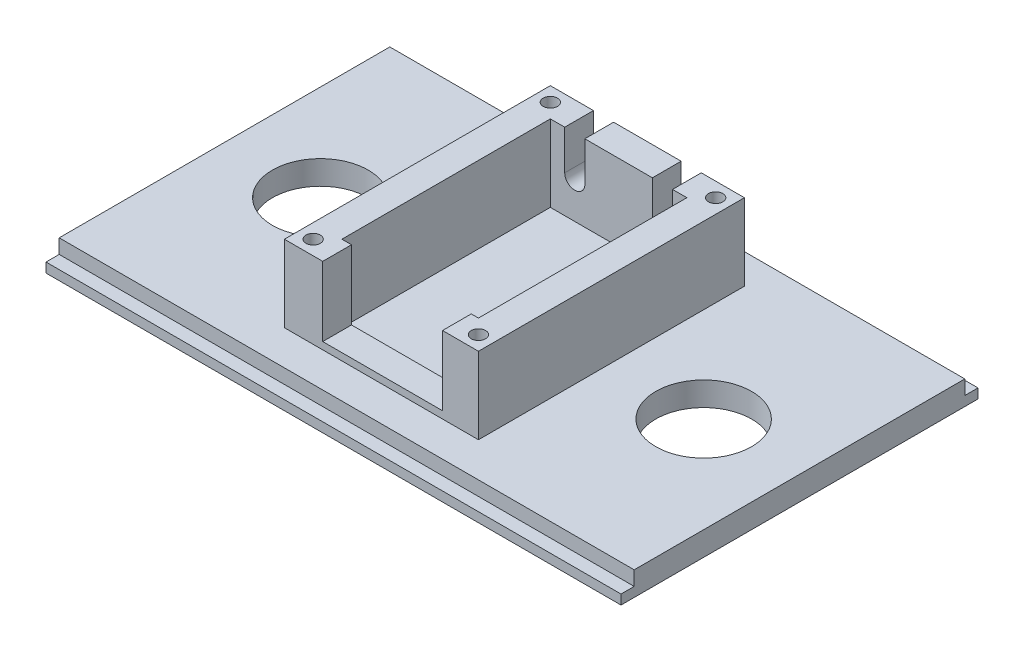
ISO-10303-21;
HEADER;
FILE_DESCRIPTION(('STEP AP214'),'2;1');
FILE_NAME('part.step','',(''),(''),'','','');
FILE_SCHEMA(('AUTOMOTIVE_DESIGN { 1 0 10303 214 1 1 1 1 }'));
ENDSEC;
DATA;
#1=APPLICATION_CONTEXT('core data for automotive mechanical design processes');
#2=APPLICATION_PROTOCOL_DEFINITION('international standard','automotive_design',2000,#1);
#3=PRODUCT_CONTEXT('',#1,'mechanical');
#4=PRODUCT('Part','Part','',(#3));
#5=PRODUCT_RELATED_PRODUCT_CATEGORY('part','',(#4));
#6=PRODUCT_DEFINITION_FORMATION('','',#4);
#7=PRODUCT_DEFINITION_CONTEXT('part definition',#1,'design');
#8=PRODUCT_DEFINITION('design','',#6,#7);
#9=PRODUCT_DEFINITION_SHAPE('','',#8);
#10=(LENGTH_UNIT() NAMED_UNIT(*) SI_UNIT(.MILLI.,.METRE.));
#11=(NAMED_UNIT(*) PLANE_ANGLE_UNIT() SI_UNIT($,.RADIAN.));
#12=(NAMED_UNIT(*) SI_UNIT($,.STERADIAN.) SOLID_ANGLE_UNIT());
#13=UNCERTAINTY_MEASURE_WITH_UNIT(LENGTH_MEASURE(1.E-05),#10,'distance_accuracy_value','');
#14=(GEOMETRIC_REPRESENTATION_CONTEXT(3) GLOBAL_UNCERTAINTY_ASSIGNED_CONTEXT((#13)) GLOBAL_UNIT_ASSIGNED_CONTEXT((#10,
#11,#12)) REPRESENTATION_CONTEXT('',''));
#15=CARTESIAN_POINT('',(0.,0.,0.));
#16=DIRECTION('',(0.,0.,1.));
#17=DIRECTION('',(1.,0.,0.));
#18=AXIS2_PLACEMENT_3D('',#15,#16,#17);
#19=CARTESIAN_POINT('',(0.,21.,0.));
#20=DIRECTION('',(0.,-1.,0.));
#21=DIRECTION('',(0.,0.,-1.));
#22=AXIS2_PLACEMENT_3D('',#19,#20,#21);
#23=PLANE('',#22);
#24=DIRECTION('',(0.,0.,-1.));
#25=VECTOR('',#24,1.);
#26=CARTESIAN_POINT('',(7.05,21.,-12.25));
#27=LINE('',#26,#25);
#28=CARTESIAN_POINT('',(7.05,21.,-22.25));
#29=VERTEX_POINT('',#28);
#30=CARTESIAN_POINT('',(7.05,21.,-28.25));
#31=VERTEX_POINT('',#30);
#32=EDGE_CURVE('E247',#29,#31,#27,.T.);
#33=ORIENTED_EDGE('',*,*,#32,.T.);
#34=DIRECTION('',(-1.,0.,0.));
#35=VECTOR('',#34,1.);
#36=CARTESIAN_POINT('',(-20.25,21.,-28.25));
#37=LINE('',#36,#35);
#38=CARTESIAN_POINT('',(-7.04999999999999,21.,-28.25));
#39=VERTEX_POINT('',#38);
#40=EDGE_CURVE('E326',#31,#39,#37,.T.);
#41=ORIENTED_EDGE('',*,*,#40,.T.);
#42=DIRECTION('',(0.,0.,-1.));
#43=VECTOR('',#42,1.);
#44=CARTESIAN_POINT('',(-7.04999999999999,21.,-12.25));
#45=LINE('',#44,#43);
#46=CARTESIAN_POINT('',(-7.04999999999999,21.,-22.25));
#47=VERTEX_POINT('',#46);
#48=EDGE_CURVE('E263',#47,#39,#45,.T.);
#49=ORIENTED_EDGE('',*,*,#48,.F.);
#50=DIRECTION('',(-1.,0.,0.));
#51=VECTOR('',#50,1.);
#52=CARTESIAN_POINT('',(14.25,21.,-22.25));
#53=LINE('',#52,#51);
#54=EDGE_CURVE('E299',#29,#47,#53,.T.);
#55=ORIENTED_EDGE('',*,*,#54,.F.);
#56=EDGE_LOOP('',(#33,#41,#49,#55));
#57=FACE_BOUND('',#56,.T.);
#58=ADVANCED_FACE('F36',(#57),#23,.F.);
#59=CARTESIAN_POINT('',(-17.25,21.,24.25));
#60=DIRECTION('',(0.,1.,0.));
#61=DIRECTION('',(0.,0.,1.));
#62=AXIS2_PLACEMENT_3D('',#59,#60,#61);
#63=CIRCLE('',#62,1.5);
#64=CARTESIAN_POINT('',(-17.25,21.,25.75));
#65=VERTEX_POINT('',#64);
#66=EDGE_CURVE('E538',#65,#65,#63,.T.);
#67=ORIENTED_EDGE('',*,*,#66,.F.);
#68=EDGE_LOOP('',(#67));
#69=FACE_BOUND('',#68,.T.);
#70=CARTESIAN_POINT('',(-17.25,21.,-25.25));
#71=DIRECTION('',(0.,1.,0.));
#72=DIRECTION('',(0.,0.,1.));
#73=AXIS2_PLACEMENT_3D('',#70,#71,#72);
#74=CIRCLE('',#73,1.5);
#75=CARTESIAN_POINT('',(-17.25,21.,-23.75));
#76=VERTEX_POINT('',#75);
#77=EDGE_CURVE('E528',#76,#76,#74,.T.);
#78=ORIENTED_EDGE('',*,*,#77,.F.);
#79=EDGE_LOOP('',(#78));
#80=FACE_BOUND('',#79,.T.);
#81=DIRECTION('',(0.,0.,-1.));
#82=VECTOR('',#81,1.);
#83=CARTESIAN_POINT('',(-11.25,21.,-12.25));
#84=LINE('',#83,#82);
#85=CARTESIAN_POINT('',(-11.25,21.,-22.25));
#86=VERTEX_POINT('',#85);
#87=CARTESIAN_POINT('',(-11.25,21.,-28.25));
#88=VERTEX_POINT('',#87);
#89=EDGE_CURVE('E59',#86,#88,#84,.T.);
#90=ORIENTED_EDGE('',*,*,#89,.T.);
#91=CARTESIAN_POINT('',(-20.25,21.,-28.25));
#92=VERTEX_POINT('',#91);
#93=EDGE_CURVE('E321',#88,#92,#37,.T.);
#94=ORIENTED_EDGE('',*,*,#93,.T.);
#95=DIRECTION('',(0.,0.,1.));
#96=VECTOR('',#95,1.);
#97=CARTESIAN_POINT('',(-20.25,21.,27.25));
#98=LINE('',#97,#96);
#99=CARTESIAN_POINT('',(-20.25,21.,27.25));
#100=VERTEX_POINT('',#99);
#101=EDGE_CURVE('E325',#92,#100,#98,.T.);
#102=ORIENTED_EDGE('',*,*,#101,.T.);
#103=DIRECTION('',(1.,0.,0.));
#104=VECTOR('',#103,1.);
#105=CARTESIAN_POINT('',(-20.25,21.,27.25));
#106=LINE('',#105,#104);
#107=CARTESIAN_POINT('',(-12.25,21.,27.25));
#108=VERTEX_POINT('',#107);
#109=EDGE_CURVE('E329',#100,#108,#106,.T.);
#110=ORIENTED_EDGE('',*,*,#109,.T.);
#111=DIRECTION('',(0.,0.,1.));
#112=VECTOR('',#111,1.);
#113=CARTESIAN_POINT('',(-12.25,21.,11.25));
#114=LINE('',#113,#112);
#115=CARTESIAN_POINT('',(-12.25,21.,21.25));
#116=VERTEX_POINT('',#115);
#117=EDGE_CURVE('E275',#116,#108,#114,.T.);
#118=ORIENTED_EDGE('',*,*,#117,.F.);
#119=DIRECTION('',(1.,0.,0.));
#120=VECTOR('',#119,1.);
#121=CARTESIAN_POINT('',(14.25,21.,21.25));
#122=LINE('',#121,#120);
#123=CARTESIAN_POINT('',(-14.25,21.,21.25));
#124=VERTEX_POINT('',#123);
#125=EDGE_CURVE('E288',#124,#116,#122,.T.);
#126=ORIENTED_EDGE('',*,*,#125,.F.);
#127=DIRECTION('',(0.,0.,1.));
#128=VECTOR('',#127,1.);
#129=CARTESIAN_POINT('',(-14.25,21.,21.25));
#130=LINE('',#129,#128);
#131=CARTESIAN_POINT('',(-14.25,21.,-22.25));
#132=VERTEX_POINT('',#131);
#133=EDGE_CURVE('E284',#132,#124,#130,.T.);
#134=ORIENTED_EDGE('',*,*,#133,.F.);
#135=EDGE_CURVE('E294',#86,#132,#53,.T.);
#136=ORIENTED_EDGE('',*,*,#135,.F.);
#137=EDGE_LOOP('',(#90,#94,#102,#110,#118,#126,#134,#136));
#138=FACE_BOUND('',#137,.T.);
#139=ADVANCED_FACE('F442',(#69,#80,#138),#23,.F.);
#140=CARTESIAN_POINT('',(0.,5.,0.));
#141=DIRECTION('',(0.,1.,0.));
#142=DIRECTION('',(0.,0.,1.));
#143=AXIS2_PLACEMENT_3D('',#140,#141,#142);
#144=PLANE('',#143);
#145=CARTESIAN_POINT('',(-40.,5.,0.));
#146=DIRECTION('',(0.,1.,0.));
#147=DIRECTION('',(0.,0.,1.));
#148=AXIS2_PLACEMENT_3D('',#145,#146,#147);
#149=CIRCLE('',#148,10.);
#150=CARTESIAN_POINT('',(-40.,5.,10.));
#151=VERTEX_POINT('',#150);
#152=EDGE_CURVE('E541',#151,#151,#149,.T.);
#153=ORIENTED_EDGE('',*,*,#152,.F.);
#154=EDGE_LOOP('',(#153));
#155=FACE_BOUND('',#154,.T.);
#156=CARTESIAN_POINT('',(40.,5.,0.));
#157=DIRECTION('',(0.,1.,0.));
#158=DIRECTION('',(0.,0.,1.));
#159=AXIS2_PLACEMENT_3D('',#156,#157,#158);
#160=CIRCLE('',#159,10.);
#161=CARTESIAN_POINT('',(40.,5.,10.));
#162=VERTEX_POINT('',#161);
#163=EDGE_CURVE('E912',#162,#162,#160,.T.);
#164=ORIENTED_EDGE('',*,*,#163,.F.);
#165=EDGE_LOOP('',(#164));
#166=FACE_BOUND('',#165,.T.);
#167=DIRECTION('',(0.,0.,1.));
#168=VECTOR('',#167,1.);
#169=CARTESIAN_POINT('',(-60.,5.,-34.5));
#170=LINE('',#169,#168);
#171=CARTESIAN_POINT('',(-60.,5.,-34.5));
#172=VERTEX_POINT('',#171);
#173=CARTESIAN_POINT('',(-60.,5.,34.5));
#174=VERTEX_POINT('',#173);
#175=EDGE_CURVE('E351',#172,#174,#170,.T.);
#176=ORIENTED_EDGE('',*,*,#175,.T.);
#177=DIRECTION('',(1.,0.,0.));
#178=VECTOR('',#177,1.);
#179=CARTESIAN_POINT('',(-60.,5.,34.5));
#180=LINE('',#179,#178);
#181=CARTESIAN_POINT('',(60.,5.,34.5));
#182=VERTEX_POINT('',#181);
#183=EDGE_CURVE('E354',#174,#182,#180,.T.);
#184=ORIENTED_EDGE('',*,*,#183,.T.);
#185=DIRECTION('',(0.,0.,-1.));
#186=VECTOR('',#185,1.);
#187=CARTESIAN_POINT('',(60.,5.,-34.5));
#188=LINE('',#187,#186);
#189=CARTESIAN_POINT('',(60.,5.,-34.5));
#190=VERTEX_POINT('',#189);
#191=EDGE_CURVE('E357',#182,#190,#188,.T.);
#192=ORIENTED_EDGE('',*,*,#191,.T.);
#193=DIRECTION('',(-1.,0.,0.));
#194=VECTOR('',#193,1.);
#195=CARTESIAN_POINT('',(-60.,5.,-34.5));
#196=LINE('',#195,#194);
#197=EDGE_CURVE('E359',#190,#172,#196,.T.);
#198=ORIENTED_EDGE('',*,*,#197,.T.);
#199=EDGE_LOOP('',(#176,#184,#192,#198));
#200=FACE_BOUND('',#199,.T.);
#201=DIRECTION('',(-1.,0.,0.));
#202=VECTOR('',#201,1.);
#203=CARTESIAN_POINT('',(-20.25,5.,-28.25));
#204=LINE('',#203,#202);
#205=CARTESIAN_POINT('',(20.25,5.,-28.25));
#206=VERTEX_POINT('',#205);
#207=CARTESIAN_POINT('',(-20.25,5.,-28.25));
#208=VERTEX_POINT('',#207);
#209=EDGE_CURVE('E335',#206,#208,#204,.T.);
#210=ORIENTED_EDGE('',*,*,#209,.F.);
#211=DIRECTION('',(0.,0.,-1.));
#212=VECTOR('',#211,1.);
#213=CARTESIAN_POINT('',(20.25,5.,27.25));
#214=LINE('',#213,#212);
#215=CARTESIAN_POINT('',(20.25,5.,27.25));
#216=VERTEX_POINT('',#215);
#217=EDGE_CURVE('E317',#216,#206,#214,.T.);
#218=ORIENTED_EDGE('',*,*,#217,.F.);
#219=DIRECTION('',(1.,0.,0.));
#220=VECTOR('',#219,1.);
#221=CARTESIAN_POINT('',(-20.25,5.,27.25));
#222=LINE('',#221,#220);
#223=CARTESIAN_POINT('',(-20.25,5.,27.25));
#224=VERTEX_POINT('',#223);
#225=EDGE_CURVE('E322',#224,#216,#222,.T.);
#226=ORIENTED_EDGE('',*,*,#225,.F.);
#227=DIRECTION('',(0.,0.,1.));
#228=VECTOR('',#227,1.);
#229=CARTESIAN_POINT('',(-20.25,5.,27.25));
#230=LINE('',#229,#228);
#231=EDGE_CURVE('E337',#208,#224,#230,.T.);
#232=ORIENTED_EDGE('',*,*,#231,.F.);
#233=EDGE_LOOP('',(#210,#218,#226,#232));
#234=FACE_BOUND('',#233,.T.);
#235=ADVANCED_FACE('F471',(#155,#166,#200,#234),#144,.T.);
#236=CARTESIAN_POINT('',(0.,2.,0.));
#237=DIRECTION('',(0.,-1.,0.));
#238=DIRECTION('',(0.,0.,-1.));
#239=AXIS2_PLACEMENT_3D('',#236,#237,#238);
#240=PLANE('',#239);
#241=DIRECTION('',(-1.,0.,0.));
#242=VECTOR('',#241,1.);
#243=CARTESIAN_POINT('',(-60.,2.,-34.5));
#244=LINE('',#243,#242);
#245=CARTESIAN_POINT('',(60.,2.,-34.5));
#246=VERTEX_POINT('',#245);
#247=CARTESIAN_POINT('',(-60.,2.,-34.5));
#248=VERTEX_POINT('',#247);
#249=EDGE_CURVE('E355',#246,#248,#244,.T.);
#250=ORIENTED_EDGE('',*,*,#249,.F.);
#251=DIRECTION('',(0.,0.,-1.));
#252=VECTOR('',#251,1.);
#253=CARTESIAN_POINT('',(60.,2.,37.25));
#254=LINE('',#253,#252);
#255=CARTESIAN_POINT('',(60.,2.,-37.25));
#256=VERTEX_POINT('',#255);
#257=EDGE_CURVE('E381',#246,#256,#254,.T.);
#258=ORIENTED_EDGE('',*,*,#257,.T.);
#259=DIRECTION('',(-1.,0.,0.));
#260=VECTOR('',#259,1.);
#261=CARTESIAN_POINT('',(-60.,2.,-37.25));
#262=LINE('',#261,#260);
#263=CARTESIAN_POINT('',(-60.,2.,-37.25));
#264=VERTEX_POINT('',#263);
#265=EDGE_CURVE('E380',#256,#264,#262,.T.);
#266=ORIENTED_EDGE('',*,*,#265,.T.);
#267=DIRECTION('',(0.,0.,1.));
#268=VECTOR('',#267,1.);
#269=CARTESIAN_POINT('',(-60.,2.,37.25));
#270=LINE('',#269,#268);
#271=EDGE_CURVE('E384',#264,#248,#270,.T.);
#272=ORIENTED_EDGE('',*,*,#271,.T.);
#273=EDGE_LOOP('',(#250,#258,#266,#272));
#274=FACE_BOUND('',#273,.T.);
#275=ADVANCED_FACE('F787',(#274),#240,.F.);
#276=DIRECTION('',(1.,0.,0.));
#277=VECTOR('',#276,1.);
#278=CARTESIAN_POINT('',(-60.,2.,34.5));
#279=LINE('',#278,#277);
#280=CARTESIAN_POINT('',(-60.,2.,34.5));
#281=VERTEX_POINT('',#280);
#282=CARTESIAN_POINT('',(60.,2.,34.5));
#283=VERTEX_POINT('',#282);
#284=EDGE_CURVE('E350',#281,#283,#279,.T.);
#285=ORIENTED_EDGE('',*,*,#284,.F.);
#286=CARTESIAN_POINT('',(-60.,2.,37.25));
#287=VERTEX_POINT('',#286);
#288=EDGE_CURVE('E383',#281,#287,#270,.T.);
#289=ORIENTED_EDGE('',*,*,#288,.T.);
#290=DIRECTION('',(1.,0.,0.));
#291=VECTOR('',#290,1.);
#292=CARTESIAN_POINT('',(-60.,2.,37.25));
#293=LINE('',#292,#291);
#294=CARTESIAN_POINT('',(60.,2.,37.25));
#295=VERTEX_POINT('',#294);
#296=EDGE_CURVE('E386',#287,#295,#293,.T.);
#297=ORIENTED_EDGE('',*,*,#296,.T.);
#298=EDGE_CURVE('E378',#295,#283,#254,.T.);
#299=ORIENTED_EDGE('',*,*,#298,.T.);
#300=EDGE_LOOP('',(#285,#289,#297,#299));
#301=FACE_BOUND('',#300,.T.);
#302=ADVANCED_FACE('F831',(#301),#240,.F.);
#303=CARTESIAN_POINT('',(60.,2.,37.25));
#304=DIRECTION('',(-1.,0.,0.));
#305=DIRECTION('',(0.,0.,1.));
#306=AXIS2_PLACEMENT_3D('',#303,#304,#305);
#307=PLANE('',#306);
#308=DIRECTION('',(0.,0.,-1.));
#309=VECTOR('',#308,1.);
#310=CARTESIAN_POINT('',(60.,0.,37.25));
#311=LINE('',#310,#309);
#312=CARTESIAN_POINT('',(60.,0.,37.25));
#313=VERTEX_POINT('',#312);
#314=CARTESIAN_POINT('',(60.,0.,-37.25));
#315=VERTEX_POINT('',#314);
#316=EDGE_CURVE('E377',#313,#315,#311,.T.);
#317=ORIENTED_EDGE('',*,*,#316,.T.);
#318=DIRECTION('',(0.,-1.,0.));
#319=VECTOR('',#318,1.);
#320=CARTESIAN_POINT('',(60.,2.,-37.25));
#321=LINE('',#320,#319);
#322=EDGE_CURVE('E405',#256,#315,#321,.T.);
#323=ORIENTED_EDGE('',*,*,#322,.F.);
#324=ORIENTED_EDGE('',*,*,#257,.F.);
#325=DIRECTION('',(0.,-1.,0.));
#326=VECTOR('',#325,1.);
#327=CARTESIAN_POINT('',(60.,5.,-34.5));
#328=LINE('',#327,#326);
#329=EDGE_CURVE('E368',#190,#246,#328,.T.);
#330=ORIENTED_EDGE('',*,*,#329,.F.);
#331=ORIENTED_EDGE('',*,*,#191,.F.);
#332=DIRECTION('',(0.,-1.,0.));
#333=VECTOR('',#332,1.);
#334=CARTESIAN_POINT('',(60.,5.,34.5));
#335=LINE('',#334,#333);
#336=EDGE_CURVE('E371',#182,#283,#335,.T.);
#337=ORIENTED_EDGE('',*,*,#336,.T.);
#338=ORIENTED_EDGE('',*,*,#298,.F.);
#339=DIRECTION('',(0.,-1.,0.));
#340=VECTOR('',#339,1.);
#341=CARTESIAN_POINT('',(60.,2.,37.25));
#342=LINE('',#341,#340);
#343=EDGE_CURVE('E388',#295,#313,#342,.T.);
#344=ORIENTED_EDGE('',*,*,#343,.T.);
#345=EDGE_LOOP('',(#317,#323,#324,#330,#331,#337,#338,#344));
#346=FACE_BOUND('',#345,.T.);
#347=ADVANCED_FACE('F38',(#346),#307,.F.);
#348=CARTESIAN_POINT('',(-60.,2.,-37.25));
#349=DIRECTION('',(0.,0.,1.));
#350=DIRECTION('',(1.,0.,0.));
#351=AXIS2_PLACEMENT_3D('',#348,#349,#350);
#352=PLANE('',#351);
#353=DIRECTION('',(-1.,0.,0.));
#354=VECTOR('',#353,1.);
#355=CARTESIAN_POINT('',(-60.,0.,-37.25));
#356=LINE('',#355,#354);
#357=CARTESIAN_POINT('',(-60.,0.,-37.25));
#358=VERTEX_POINT('',#357);
#359=EDGE_CURVE('E391',#315,#358,#356,.T.);
#360=ORIENTED_EDGE('',*,*,#359,.T.);
#361=DIRECTION('',(0.,-1.,0.));
#362=VECTOR('',#361,1.);
#363=CARTESIAN_POINT('',(-60.,2.,-37.25));
#364=LINE('',#363,#362);
#365=EDGE_CURVE('E402',#264,#358,#364,.T.);
#366=ORIENTED_EDGE('',*,*,#365,.F.);
#367=ORIENTED_EDGE('',*,*,#265,.F.);
#368=ORIENTED_EDGE('',*,*,#322,.T.);
#369=EDGE_LOOP('',(#360,#366,#367,#368));
#370=FACE_BOUND('',#369,.T.);
#371=ADVANCED_FACE('F817',(#370),#352,.F.);
#372=CARTESIAN_POINT('',(-60.,2.,37.25));
#373=DIRECTION('',(1.,0.,0.));
#374=DIRECTION('',(0.,0.,-1.));
#375=AXIS2_PLACEMENT_3D('',#372,#373,#374);
#376=PLANE('',#375);
#377=DIRECTION('',(0.,0.,1.));
#378=VECTOR('',#377,1.);
#379=CARTESIAN_POINT('',(-60.,0.,37.25));
#380=LINE('',#379,#378);
#381=CARTESIAN_POINT('',(-60.,0.,37.25));
#382=VERTEX_POINT('',#381);
#383=EDGE_CURVE('E393',#358,#382,#380,.T.);
#384=ORIENTED_EDGE('',*,*,#383,.T.);
#385=DIRECTION('',(0.,-1.,0.));
#386=VECTOR('',#385,1.);
#387=CARTESIAN_POINT('',(-60.,2.,37.25));
#388=LINE('',#387,#386);
#389=EDGE_CURVE('E399',#287,#382,#388,.T.);
#390=ORIENTED_EDGE('',*,*,#389,.F.);
#391=ORIENTED_EDGE('',*,*,#288,.F.);
#392=DIRECTION('',(0.,-1.,0.));
#393=VECTOR('',#392,1.);
#394=CARTESIAN_POINT('',(-60.,5.,34.5));
#395=LINE('',#394,#393);
#396=EDGE_CURVE('E374',#174,#281,#395,.T.);
#397=ORIENTED_EDGE('',*,*,#396,.F.);
#398=ORIENTED_EDGE('',*,*,#175,.F.);
#399=DIRECTION('',(0.,-1.,0.));
#400=VECTOR('',#399,1.);
#401=CARTESIAN_POINT('',(-60.,5.,-34.5));
#402=LINE('',#401,#400);
#403=EDGE_CURVE('E361',#172,#248,#402,.T.);
#404=ORIENTED_EDGE('',*,*,#403,.T.);
#405=ORIENTED_EDGE('',*,*,#271,.F.);
#406=ORIENTED_EDGE('',*,*,#365,.T.);
#407=EDGE_LOOP('',(#384,#390,#391,#397,#398,#404,#405,#406));
#408=FACE_BOUND('',#407,.T.);
#409=ADVANCED_FACE('F810',(#408),#376,.F.);
#410=CARTESIAN_POINT('',(-60.,2.,37.25));
#411=DIRECTION('',(0.,0.,-1.));
#412=DIRECTION('',(-1.,0.,0.));
#413=AXIS2_PLACEMENT_3D('',#410,#411,#412);
#414=PLANE('',#413);
#415=DIRECTION('',(1.,0.,0.));
#416=VECTOR('',#415,1.);
#417=CARTESIAN_POINT('',(-60.,0.,37.25));
#418=LINE('',#417,#416);
#419=EDGE_CURVE('E395',#382,#313,#418,.T.);
#420=ORIENTED_EDGE('',*,*,#419,.T.);
#421=ORIENTED_EDGE('',*,*,#343,.F.);
#422=ORIENTED_EDGE('',*,*,#296,.F.);
#423=ORIENTED_EDGE('',*,*,#389,.T.);
#424=EDGE_LOOP('',(#420,#421,#422,#423));
#425=FACE_BOUND('',#424,.T.);
#426=ADVANCED_FACE('F816',(#425),#414,.F.);
#427=CARTESIAN_POINT('',(0.,0.,0.));
#428=DIRECTION('',(0.,-1.,0.));
#429=DIRECTION('',(0.,0.,-1.));
#430=AXIS2_PLACEMENT_3D('',#427,#428,#429);
#431=PLANE('',#430);
#432=CARTESIAN_POINT('',(-40.,0.,0.));
#433=DIRECTION('',(0.,1.,0.));
#434=DIRECTION('',(0.,0.,1.));
#435=AXIS2_PLACEMENT_3D('',#432,#433,#434);
#436=CIRCLE('',#435,10.);
#437=CARTESIAN_POINT('',(-40.,0.,10.));
#438=VERTEX_POINT('',#437);
#439=EDGE_CURVE('E906',#438,#438,#436,.T.);
#440=ORIENTED_EDGE('',*,*,#439,.T.);
#441=EDGE_LOOP('',(#440));
#442=FACE_BOUND('',#441,.T.);
#443=CARTESIAN_POINT('',(40.,0.,0.));
#444=DIRECTION('',(0.,1.,0.));
#445=DIRECTION('',(0.,0.,1.));
#446=AXIS2_PLACEMENT_3D('',#443,#444,#445);
#447=CIRCLE('',#446,10.);
#448=CARTESIAN_POINT('',(40.,0.,10.));
#449=VERTEX_POINT('',#448);
#450=EDGE_CURVE('E909',#449,#449,#447,.T.);
#451=ORIENTED_EDGE('',*,*,#450,.T.);
#452=EDGE_LOOP('',(#451));
#453=FACE_BOUND('',#452,.T.);
#454=ORIENTED_EDGE('',*,*,#316,.F.);
#455=ORIENTED_EDGE('',*,*,#419,.F.);
#456=ORIENTED_EDGE('',*,*,#383,.F.);
#457=ORIENTED_EDGE('',*,*,#359,.F.);
#458=EDGE_LOOP('',(#454,#455,#456,#457));
#459=FACE_BOUND('',#458,.T.);
#460=ADVANCED_FACE('F805',(#442,#453,#459),#431,.T.);
#461=CARTESIAN_POINT('',(-60.,5.,34.5));
#462=DIRECTION('',(0.,0.,-1.));
#463=DIRECTION('',(-1.,0.,0.));
#464=AXIS2_PLACEMENT_3D('',#461,#462,#463);
#465=PLANE('',#464);
#466=ORIENTED_EDGE('',*,*,#284,.T.);
#467=ORIENTED_EDGE('',*,*,#336,.F.);
#468=ORIENTED_EDGE('',*,*,#183,.F.);
#469=ORIENTED_EDGE('',*,*,#396,.T.);
#470=EDGE_LOOP('',(#466,#467,#468,#469));
#471=FACE_BOUND('',#470,.T.);
#472=ADVANCED_FACE('F513',(#471),#465,.F.);
#473=CARTESIAN_POINT('',(-60.,5.,-34.5));
#474=DIRECTION('',(0.,0.,1.));
#475=DIRECTION('',(1.,0.,0.));
#476=AXIS2_PLACEMENT_3D('',#473,#474,#475);
#477=PLANE('',#476);
#478=ORIENTED_EDGE('',*,*,#249,.T.);
#479=ORIENTED_EDGE('',*,*,#403,.F.);
#480=ORIENTED_EDGE('',*,*,#197,.F.);
#481=ORIENTED_EDGE('',*,*,#329,.T.);
#482=EDGE_LOOP('',(#478,#479,#480,#481));
#483=FACE_BOUND('',#482,.T.);
#484=ADVANCED_FACE('F506',(#483),#477,.F.);
#485=CARTESIAN_POINT('',(17.25,21.,24.25));
#486=DIRECTION('',(0.,1.,0.));
#487=DIRECTION('',(0.,0.,1.));
#488=AXIS2_PLACEMENT_3D('',#485,#486,#487);
#489=CIRCLE('',#488,1.5);
#490=CARTESIAN_POINT('',(17.25,21.,25.75));
#491=VERTEX_POINT('',#490);
#492=EDGE_CURVE('E519',#491,#491,#489,.T.);
#493=ORIENTED_EDGE('',*,*,#492,.F.);
#494=EDGE_LOOP('',(#493));
#495=FACE_BOUND('',#494,.T.);
#496=CARTESIAN_POINT('',(17.25,21.,-25.25));
#497=DIRECTION('',(0.,1.,0.));
#498=DIRECTION('',(0.,0.,1.));
#499=AXIS2_PLACEMENT_3D('',#496,#497,#498);
#500=CIRCLE('',#499,1.5);
#501=CARTESIAN_POINT('',(17.25,21.,-23.75));
#502=VERTEX_POINT('',#501);
#503=EDGE_CURVE('E522',#502,#502,#500,.T.);
#504=ORIENTED_EDGE('',*,*,#503,.F.);
#505=EDGE_LOOP('',(#504));
#506=FACE_BOUND('',#505,.T.);
#507=CARTESIAN_POINT('',(20.25,21.,-28.25));
#508=VERTEX_POINT('',#507);
#509=CARTESIAN_POINT('',(11.25,21.,-28.25));
#510=VERTEX_POINT('',#509);
#511=EDGE_CURVE('E323',#508,#510,#37,.T.);
#512=ORIENTED_EDGE('',*,*,#511,.T.);
#513=DIRECTION('',(0.,0.,-1.));
#514=VECTOR('',#513,1.);
#515=CARTESIAN_POINT('',(11.25,21.,-12.25));
#516=LINE('',#515,#514);
#517=CARTESIAN_POINT('',(11.25,21.,-22.25));
#518=VERTEX_POINT('',#517);
#519=EDGE_CURVE('E234',#518,#510,#516,.T.);
#520=ORIENTED_EDGE('',*,*,#519,.F.);
#521=CARTESIAN_POINT('',(14.25,21.,-22.25));
#522=VERTEX_POINT('',#521);
#523=EDGE_CURVE('E295',#522,#518,#53,.T.);
#524=ORIENTED_EDGE('',*,*,#523,.F.);
#525=DIRECTION('',(0.,0.,-1.));
#526=VECTOR('',#525,1.);
#527=CARTESIAN_POINT('',(14.25,21.,21.25));
#528=LINE('',#527,#526);
#529=CARTESIAN_POINT('',(14.25,21.,21.25));
#530=VERTEX_POINT('',#529);
#531=EDGE_CURVE('E291',#530,#522,#528,.T.);
#532=ORIENTED_EDGE('',*,*,#531,.F.);
#533=CARTESIAN_POINT('',(12.75,21.,21.25));
#534=VERTEX_POINT('',#533);
#535=EDGE_CURVE('E286',#534,#530,#122,.T.);
#536=ORIENTED_EDGE('',*,*,#535,.F.);
#537=DIRECTION('',(0.,0.,1.));
#538=VECTOR('',#537,1.);
#539=CARTESIAN_POINT('',(12.75,21.,11.25));
#540=LINE('',#539,#538);
#541=CARTESIAN_POINT('',(12.75,21.,27.25));
#542=VERTEX_POINT('',#541);
#543=EDGE_CURVE('E278',#534,#542,#540,.T.);
#544=ORIENTED_EDGE('',*,*,#543,.T.);
#545=CARTESIAN_POINT('',(20.25,21.,27.25));
#546=VERTEX_POINT('',#545);
#547=EDGE_CURVE('E328',#542,#546,#106,.T.);
#548=ORIENTED_EDGE('',*,*,#547,.T.);
#549=DIRECTION('',(0.,0.,-1.));
#550=VECTOR('',#549,1.);
#551=CARTESIAN_POINT('',(20.25,21.,27.25));
#552=LINE('',#551,#550);
#553=EDGE_CURVE('E318',#546,#508,#552,.T.);
#554=ORIENTED_EDGE('',*,*,#553,.T.);
#555=EDGE_LOOP('',(#512,#520,#524,#532,#536,#544,#548,#554));
#556=FACE_BOUND('',#555,.T.);
#557=ADVANCED_FACE('F459',(#495,#506,#556),#23,.F.);
#558=CARTESIAN_POINT('',(20.25,21.,27.25));
#559=DIRECTION('',(-1.,0.,0.));
#560=DIRECTION('',(0.,0.,1.));
#561=AXIS2_PLACEMENT_3D('',#558,#559,#560);
#562=PLANE('',#561);
#563=ORIENTED_EDGE('',*,*,#217,.T.);
#564=DIRECTION('',(0.,-1.,0.));
#565=VECTOR('',#564,1.);
#566=CARTESIAN_POINT('',(20.25,21.,-28.25));
#567=LINE('',#566,#565);
#568=EDGE_CURVE('E348',#508,#206,#567,.T.);
#569=ORIENTED_EDGE('',*,*,#568,.F.);
#570=ORIENTED_EDGE('',*,*,#553,.F.);
#571=DIRECTION('',(0.,-1.,0.));
#572=VECTOR('',#571,1.);
#573=CARTESIAN_POINT('',(20.25,21.,27.25));
#574=LINE('',#573,#572);
#575=EDGE_CURVE('E332',#546,#216,#574,.T.);
#576=ORIENTED_EDGE('',*,*,#575,.T.);
#577=EDGE_LOOP('',(#563,#569,#570,#576));
#578=FACE_BOUND('',#577,.T.);
#579=ADVANCED_FACE('F466',(#578),#562,.F.);
#580=CARTESIAN_POINT('',(-20.25,21.,-28.25));
#581=DIRECTION('',(0.,0.,1.));
#582=DIRECTION('',(1.,0.,0.));
#583=AXIS2_PLACEMENT_3D('',#580,#581,#582);
#584=PLANE('',#583);
#585=CARTESIAN_POINT('',(9.15,12.75,-28.25));
#586=DIRECTION('',(0.,0.,-1.));
#587=DIRECTION('',(-1.,0.,0.));
#588=AXIS2_PLACEMENT_3D('',#585,#586,#587);
#589=CIRCLE('',#588,2.1);
#590=CARTESIAN_POINT('',(11.25,12.75,-28.25));
#591=VERTEX_POINT('',#590);
#592=CARTESIAN_POINT('',(7.05,12.75,-28.25));
#593=VERTEX_POINT('',#592);
#594=EDGE_CURVE('E222',#591,#593,#589,.T.);
#595=ORIENTED_EDGE('',*,*,#594,.F.);
#596=DIRECTION('',(0.,-1.,0.));
#597=VECTOR('',#596,1.);
#598=CARTESIAN_POINT('',(11.25,0.,-28.25));
#599=LINE('',#598,#597);
#600=EDGE_CURVE('E231',#510,#591,#599,.T.);
#601=ORIENTED_EDGE('',*,*,#600,.F.);
#602=ORIENTED_EDGE('',*,*,#511,.F.);
#603=ORIENTED_EDGE('',*,*,#568,.T.);
#604=ORIENTED_EDGE('',*,*,#209,.T.);
#605=DIRECTION('',(0.,-1.,0.));
#606=VECTOR('',#605,1.);
#607=CARTESIAN_POINT('',(-20.25,21.,-28.25));
#608=LINE('',#607,#606);
#609=EDGE_CURVE('E345',#92,#208,#608,.T.);
#610=ORIENTED_EDGE('',*,*,#609,.F.);
#611=ORIENTED_EDGE('',*,*,#93,.F.);
#612=DIRECTION('',(0.,-1.,0.));
#613=VECTOR('',#612,1.);
#614=CARTESIAN_POINT('',(-11.25,0.,-28.25));
#615=LINE('',#614,#613);
#616=CARTESIAN_POINT('',(-11.25,12.75,-28.25));
#617=VERTEX_POINT('',#616);
#618=EDGE_CURVE('E254',#88,#617,#615,.T.);
#619=ORIENTED_EDGE('',*,*,#618,.T.);
#620=CARTESIAN_POINT('',(-9.14999999999999,12.75,-28.25));
#621=DIRECTION('',(0.,0.,-1.));
#622=DIRECTION('',(-1.,0.,0.));
#623=AXIS2_PLACEMENT_3D('',#620,#621,#622);
#624=CIRCLE('',#623,2.1);
#625=CARTESIAN_POINT('',(-7.04999999999999,12.75,-28.25));
#626=VERTEX_POINT('',#625);
#627=EDGE_CURVE('E251',#626,#617,#624,.T.);
#628=ORIENTED_EDGE('',*,*,#627,.F.);
#629=DIRECTION('',(0.,-1.,0.));
#630=VECTOR('',#629,1.);
#631=CARTESIAN_POINT('',(-7.04999999999999,0.,-28.25));
#632=LINE('',#631,#630);
#633=EDGE_CURVE('E258',#39,#626,#632,.T.);
#634=ORIENTED_EDGE('',*,*,#633,.F.);
#635=ORIENTED_EDGE('',*,*,#40,.F.);
#636=DIRECTION('',(0.,-1.,0.));
#637=VECTOR('',#636,1.);
#638=CARTESIAN_POINT('',(7.05,0.,-28.25));
#639=LINE('',#638,#637);
#640=EDGE_CURVE('E228',#31,#593,#639,.T.);
#641=ORIENTED_EDGE('',*,*,#640,.T.);
#642=EDGE_LOOP('',(#595,#601,#602,#603,#604,#610,#611,#619,#628,#634,#635,#641));
#643=FACE_BOUND('',#642,.T.);
#644=ADVANCED_FACE('F239',(#643),#584,.F.);
#645=CARTESIAN_POINT('',(-20.25,21.,27.25));
#646=DIRECTION('',(1.,0.,0.));
#647=DIRECTION('',(0.,0.,-1.));
#648=AXIS2_PLACEMENT_3D('',#645,#646,#647);
#649=PLANE('',#648);
#650=ORIENTED_EDGE('',*,*,#231,.T.);
#651=DIRECTION('',(0.,-1.,0.));
#652=VECTOR('',#651,1.);
#653=CARTESIAN_POINT('',(-20.25,21.,27.25));
#654=LINE('',#653,#652);
#655=EDGE_CURVE('E343',#100,#224,#654,.T.);
#656=ORIENTED_EDGE('',*,*,#655,.F.);
#657=ORIENTED_EDGE('',*,*,#101,.F.);
#658=ORIENTED_EDGE('',*,*,#609,.T.);
#659=EDGE_LOOP('',(#650,#656,#657,#658));
#660=FACE_BOUND('',#659,.T.);
#661=ADVANCED_FACE('F474',(#660),#649,.F.);
#662=CARTESIAN_POINT('',(-20.25,21.,27.25));
#663=DIRECTION('',(0.,0.,-1.));
#664=DIRECTION('',(-1.,0.,0.));
#665=AXIS2_PLACEMENT_3D('',#662,#663,#664);
#666=PLANE('',#665);
#667=DIRECTION('',(1.,0.,0.));
#668=VECTOR('',#667,1.);
#669=CARTESIAN_POINT('',(-12.25,6.5,27.25));
#670=LINE('',#669,#668);
#671=CARTESIAN_POINT('',(-12.25,6.5,27.25));
#672=VERTEX_POINT('',#671);
#673=CARTESIAN_POINT('',(12.75,6.5,27.25));
#674=VERTEX_POINT('',#673);
#675=EDGE_CURVE('E269',#672,#674,#670,.T.);
#676=ORIENTED_EDGE('',*,*,#675,.F.);
#677=DIRECTION('',(0.,-1.,0.));
#678=VECTOR('',#677,1.);
#679=CARTESIAN_POINT('',(-12.25,21.,27.25));
#680=LINE('',#679,#678);
#681=EDGE_CURVE('E246',#108,#672,#680,.T.);
#682=ORIENTED_EDGE('',*,*,#681,.F.);
#683=ORIENTED_EDGE('',*,*,#109,.F.);
#684=ORIENTED_EDGE('',*,*,#655,.T.);
#685=ORIENTED_EDGE('',*,*,#225,.T.);
#686=ORIENTED_EDGE('',*,*,#575,.F.);
#687=ORIENTED_EDGE('',*,*,#547,.F.);
#688=DIRECTION('',(0.,1.,0.));
#689=VECTOR('',#688,1.);
#690=CARTESIAN_POINT('',(12.75,21.,27.25));
#691=LINE('',#690,#689);
#692=EDGE_CURVE('E272',#674,#542,#691,.T.);
#693=ORIENTED_EDGE('',*,*,#692,.F.);
#694=EDGE_LOOP('',(#676,#682,#683,#684,#685,#686,#687,#693));
#695=FACE_BOUND('',#694,.T.);
#696=ADVANCED_FACE('F752',(#695),#666,.F.);
#697=CARTESIAN_POINT('',(-14.25,21.,21.25));
#698=DIRECTION('',(1.,0.,0.));
#699=DIRECTION('',(0.,0.,-1.));
#700=AXIS2_PLACEMENT_3D('',#697,#698,#699);
#701=PLANE('',#700);
#702=DIRECTION('',(0.,0.,1.));
#703=VECTOR('',#702,1.);
#704=CARTESIAN_POINT('',(-14.25,5.,21.25));
#705=LINE('',#704,#703);
#706=CARTESIAN_POINT('',(-14.25,5.,-22.25));
#707=VERTEX_POINT('',#706);
#708=CARTESIAN_POINT('',(-14.25,5.,21.25));
#709=VERTEX_POINT('',#708);
#710=EDGE_CURVE('E277',#707,#709,#705,.T.);
#711=ORIENTED_EDGE('',*,*,#710,.F.);
#712=DIRECTION('',(0.,-1.,0.));
#713=VECTOR('',#712,1.);
#714=CARTESIAN_POINT('',(-14.25,21.,-22.25));
#715=LINE('',#714,#713);
#716=EDGE_CURVE('E298',#132,#707,#715,.T.);
#717=ORIENTED_EDGE('',*,*,#716,.F.);
#718=ORIENTED_EDGE('',*,*,#133,.T.);
#719=DIRECTION('',(0.,-1.,0.));
#720=VECTOR('',#719,1.);
#721=CARTESIAN_POINT('',(-14.25,21.,21.25));
#722=LINE('',#721,#720);
#723=EDGE_CURVE('E314',#124,#709,#722,.T.);
#724=ORIENTED_EDGE('',*,*,#723,.T.);
#725=EDGE_LOOP('',(#711,#717,#718,#724));
#726=FACE_BOUND('',#725,.T.);
#727=ADVANCED_FACE('F439',(#726),#701,.T.);
#728=CARTESIAN_POINT('',(14.25,21.,21.25));
#729=DIRECTION('',(0.,0.,-1.));
#730=DIRECTION('',(-1.,0.,0.));
#731=AXIS2_PLACEMENT_3D('',#728,#729,#730);
#732=PLANE('',#731);
#733=DIRECTION('',(0.,1.,0.));
#734=VECTOR('',#733,1.);
#735=CARTESIAN_POINT('',(-12.25,21.,21.25));
#736=LINE('',#735,#734);
#737=CARTESIAN_POINT('',(-12.25,6.5,21.25));
#738=VERTEX_POINT('',#737);
#739=EDGE_CURVE('E413',#738,#116,#736,.T.);
#740=ORIENTED_EDGE('',*,*,#739,.F.);
#741=DIRECTION('',(-1.,0.,0.));
#742=VECTOR('',#741,1.);
#743=CARTESIAN_POINT('',(14.25,6.5,21.25));
#744=LINE('',#743,#742);
#745=CARTESIAN_POINT('',(12.75,6.5,21.25));
#746=VERTEX_POINT('',#745);
#747=EDGE_CURVE('E408',#746,#738,#744,.T.);
#748=ORIENTED_EDGE('',*,*,#747,.F.);
#749=DIRECTION('',(0.,-1.,0.));
#750=VECTOR('',#749,1.);
#751=CARTESIAN_POINT('',(12.75,21.,21.25));
#752=LINE('',#751,#750);
#753=EDGE_CURVE('E410',#534,#746,#752,.T.);
#754=ORIENTED_EDGE('',*,*,#753,.F.);
#755=ORIENTED_EDGE('',*,*,#535,.T.);
#756=DIRECTION('',(0.,-1.,0.));
#757=VECTOR('',#756,1.);
#758=CARTESIAN_POINT('',(14.25,21.,21.25));
#759=LINE('',#758,#757);
#760=CARTESIAN_POINT('',(14.25,5.,21.25));
#761=VERTEX_POINT('',#760);
#762=EDGE_CURVE('E311',#530,#761,#759,.T.);
#763=ORIENTED_EDGE('',*,*,#762,.T.);
#764=DIRECTION('',(1.,0.,0.));
#765=VECTOR('',#764,1.);
#766=CARTESIAN_POINT('',(14.25,5.,21.25));
#767=LINE('',#766,#765);
#768=EDGE_CURVE('E301',#709,#761,#767,.T.);
#769=ORIENTED_EDGE('',*,*,#768,.F.);
#770=ORIENTED_EDGE('',*,*,#723,.F.);
#771=ORIENTED_EDGE('',*,*,#125,.T.);
#772=EDGE_LOOP('',(#740,#748,#754,#755,#763,#769,#770,#771));
#773=FACE_BOUND('',#772,.T.);
#774=ADVANCED_FACE('F446',(#773),#732,.T.);
#775=CARTESIAN_POINT('',(14.25,21.,21.25));
#776=DIRECTION('',(-1.,0.,0.));
#777=DIRECTION('',(0.,0.,1.));
#778=AXIS2_PLACEMENT_3D('',#775,#776,#777);
#779=PLANE('',#778);
#780=DIRECTION('',(0.,0.,-1.));
#781=VECTOR('',#780,1.);
#782=CARTESIAN_POINT('',(14.25,5.,21.25));
#783=LINE('',#782,#781);
#784=CARTESIAN_POINT('',(14.25,5.,-22.25));
#785=VERTEX_POINT('',#784);
#786=EDGE_CURVE('E303',#761,#785,#783,.T.);
#787=ORIENTED_EDGE('',*,*,#786,.F.);
#788=ORIENTED_EDGE('',*,*,#762,.F.);
#789=ORIENTED_EDGE('',*,*,#531,.T.);
#790=DIRECTION('',(0.,-1.,0.));
#791=VECTOR('',#790,1.);
#792=CARTESIAN_POINT('',(14.25,21.,-22.25));
#793=LINE('',#792,#791);
#794=EDGE_CURVE('E308',#522,#785,#793,.T.);
#795=ORIENTED_EDGE('',*,*,#794,.T.);
#796=EDGE_LOOP('',(#787,#788,#789,#795));
#797=FACE_BOUND('',#796,.T.);
#798=ADVANCED_FACE('F456',(#797),#779,.T.);
#799=CARTESIAN_POINT('',(14.25,21.,-22.25));
#800=DIRECTION('',(0.,0.,1.));
#801=DIRECTION('',(1.,0.,0.));
#802=AXIS2_PLACEMENT_3D('',#799,#800,#801);
#803=PLANE('',#802);
#804=DIRECTION('',(0.,1.,0.));
#805=VECTOR('',#804,1.);
#806=CARTESIAN_POINT('',(11.25,21.,-22.25));
#807=LINE('',#806,#805);
#808=CARTESIAN_POINT('',(11.25,12.75,-22.25));
#809=VERTEX_POINT('',#808);
#810=EDGE_CURVE('E11',#809,#518,#807,.T.);
#811=ORIENTED_EDGE('',*,*,#810,.F.);
#812=CARTESIAN_POINT('',(9.15,12.75,-22.25));
#813=DIRECTION('',(0.,0.,1.));
#814=DIRECTION('',(1.,0.,0.));
#815=AXIS2_PLACEMENT_3D('',#812,#813,#814);
#816=CIRCLE('',#815,2.1);
#817=CARTESIAN_POINT('',(7.05,12.75,-22.25));
#818=VERTEX_POINT('',#817);
#819=EDGE_CURVE('E225',#818,#809,#816,.T.);
#820=ORIENTED_EDGE('',*,*,#819,.F.);
#821=DIRECTION('',(0.,1.,0.));
#822=VECTOR('',#821,1.);
#823=CARTESIAN_POINT('',(7.05,21.,-22.25));
#824=LINE('',#823,#822);
#825=EDGE_CURVE('E44',#818,#29,#824,.T.);
#826=ORIENTED_EDGE('',*,*,#825,.T.);
#827=ORIENTED_EDGE('',*,*,#54,.T.);
#828=DIRECTION('',(0.,1.,0.));
#829=VECTOR('',#828,1.);
#830=CARTESIAN_POINT('',(-7.04999999999999,21.,-22.25));
#831=LINE('',#830,#829);
#832=CARTESIAN_POINT('',(-7.04999999999999,12.75,-22.25));
#833=VERTEX_POINT('',#832);
#834=EDGE_CURVE('E419',#833,#47,#831,.T.);
#835=ORIENTED_EDGE('',*,*,#834,.F.);
#836=CARTESIAN_POINT('',(-9.14999999999999,12.75,-22.25));
#837=DIRECTION('',(0.,0.,1.));
#838=DIRECTION('',(1.,0.,0.));
#839=AXIS2_PLACEMENT_3D('',#836,#837,#838);
#840=CIRCLE('',#839,2.1);
#841=CARTESIAN_POINT('',(-11.25,12.75,-22.25));
#842=VERTEX_POINT('',#841);
#843=EDGE_CURVE('E417',#842,#833,#840,.T.);
#844=ORIENTED_EDGE('',*,*,#843,.F.);
#845=DIRECTION('',(0.,1.,0.));
#846=VECTOR('',#845,1.);
#847=CARTESIAN_POINT('',(-11.25,21.,-22.25));
#848=LINE('',#847,#846);
#849=EDGE_CURVE('E415',#842,#86,#848,.T.);
#850=ORIENTED_EDGE('',*,*,#849,.T.);
#851=ORIENTED_EDGE('',*,*,#135,.T.);
#852=ORIENTED_EDGE('',*,*,#716,.T.);
#853=DIRECTION('',(-1.,0.,0.));
#854=VECTOR('',#853,1.);
#855=CARTESIAN_POINT('',(14.25,5.,-22.25));
#856=LINE('',#855,#854);
#857=EDGE_CURVE('E287',#785,#707,#856,.T.);
#858=ORIENTED_EDGE('',*,*,#857,.F.);
#859=ORIENTED_EDGE('',*,*,#794,.F.);
#860=ORIENTED_EDGE('',*,*,#523,.T.);
#861=EDGE_LOOP('',(#811,#820,#826,#827,#835,#844,#850,#851,#852,#858,#859,#860));
#862=FACE_BOUND('',#861,.T.);
#863=ADVANCED_FACE('F425',(#862),#803,.T.);
#864=ORIENTED_EDGE('',*,*,#710,.T.);
#865=ORIENTED_EDGE('',*,*,#768,.T.);
#866=ORIENTED_EDGE('',*,*,#786,.T.);
#867=ORIENTED_EDGE('',*,*,#857,.T.);
#868=EDGE_LOOP('',(#864,#865,#866,#867));
#869=FACE_BOUND('',#868,.T.);
#870=ADVANCED_FACE('F452',(#869),#144,.T.);
#871=CARTESIAN_POINT('',(-12.25,21.,11.25));
#872=DIRECTION('',(-1.,0.,0.));
#873=DIRECTION('',(0.,-1.,0.));
#874=AXIS2_PLACEMENT_3D('',#871,#872,#873);
#875=PLANE('',#874);
#876=ORIENTED_EDGE('',*,*,#739,.T.);
#877=ORIENTED_EDGE('',*,*,#117,.T.);
#878=ORIENTED_EDGE('',*,*,#681,.T.);
#879=DIRECTION('',(0.,0.,1.));
#880=VECTOR('',#879,1.);
#881=CARTESIAN_POINT('',(-12.25,6.5,11.25));
#882=LINE('',#881,#880);
#883=EDGE_CURVE('E274',#738,#672,#882,.T.);
#884=ORIENTED_EDGE('',*,*,#883,.F.);
#885=EDGE_LOOP('',(#876,#877,#878,#884));
#886=FACE_BOUND('',#885,.T.);
#887=ADVANCED_FACE('F713',(#886),#875,.F.);
#888=CARTESIAN_POINT('',(12.75,21.,11.25));
#889=DIRECTION('',(1.,0.,0.));
#890=DIRECTION('',(0.,1.,0.));
#891=AXIS2_PLACEMENT_3D('',#888,#889,#890);
#892=PLANE('',#891);
#893=ORIENTED_EDGE('',*,*,#753,.T.);
#894=DIRECTION('',(0.,0.,1.));
#895=VECTOR('',#894,1.);
#896=CARTESIAN_POINT('',(12.75,6.5,11.25));
#897=LINE('',#896,#895);
#898=EDGE_CURVE('E281',#746,#674,#897,.T.);
#899=ORIENTED_EDGE('',*,*,#898,.T.);
#900=ORIENTED_EDGE('',*,*,#692,.T.);
#901=ORIENTED_EDGE('',*,*,#543,.F.);
#902=EDGE_LOOP('',(#893,#899,#900,#901));
#903=FACE_BOUND('',#902,.T.);
#904=ADVANCED_FACE('F704',(#903),#892,.F.);
#905=CARTESIAN_POINT('',(-12.25,6.5,11.25));
#906=DIRECTION('',(0.,-1.,0.));
#907=DIRECTION('',(0.,0.,-1.));
#908=AXIS2_PLACEMENT_3D('',#905,#906,#907);
#909=PLANE('',#908);
#910=ORIENTED_EDGE('',*,*,#747,.T.);
#911=ORIENTED_EDGE('',*,*,#883,.T.);
#912=ORIENTED_EDGE('',*,*,#675,.T.);
#913=ORIENTED_EDGE('',*,*,#898,.F.);
#914=EDGE_LOOP('',(#910,#911,#912,#913));
#915=FACE_BOUND('',#914,.T.);
#916=ADVANCED_FACE('F687',(#915),#909,.F.);
#917=CARTESIAN_POINT('',(-9.14999999999999,12.75,-12.25));
#918=DIRECTION('',(0.,0.,-1.));
#919=DIRECTION('',(-1.,0.,0.));
#920=AXIS2_PLACEMENT_3D('',#917,#918,#919);
#921=CYLINDRICAL_SURFACE('',#920,2.1);
#922=ORIENTED_EDGE('',*,*,#843,.T.);
#923=DIRECTION('',(0.,0.,-1.));
#924=VECTOR('',#923,1.);
#925=CARTESIAN_POINT('',(-7.04999999999999,12.75,-12.25));
#926=LINE('',#925,#924);
#927=EDGE_CURVE('E237',#833,#626,#926,.T.);
#928=ORIENTED_EDGE('',*,*,#927,.T.);
#929=ORIENTED_EDGE('',*,*,#627,.T.);
#930=DIRECTION('',(0.,0.,-1.));
#931=VECTOR('',#930,1.);
#932=CARTESIAN_POINT('',(-11.25,12.75,-12.25));
#933=LINE('',#932,#931);
#934=EDGE_CURVE('E261',#842,#617,#933,.T.);
#935=ORIENTED_EDGE('',*,*,#934,.F.);
#936=EDGE_LOOP('',(#922,#928,#929,#935));
#937=FACE_BOUND('',#936,.T.);
#938=ADVANCED_FACE('F485',(#937),#921,.F.);
#939=CARTESIAN_POINT('',(-7.04999999999999,0.,-12.25));
#940=DIRECTION('',(1.,0.,0.));
#941=DIRECTION('',(0.,1.,0.));
#942=AXIS2_PLACEMENT_3D('',#939,#940,#941);
#943=PLANE('',#942);
#944=ORIENTED_EDGE('',*,*,#834,.T.);
#945=ORIENTED_EDGE('',*,*,#48,.T.);
#946=ORIENTED_EDGE('',*,*,#633,.T.);
#947=ORIENTED_EDGE('',*,*,#927,.F.);
#948=EDGE_LOOP('',(#944,#945,#946,#947));
#949=FACE_BOUND('',#948,.T.);
#950=ADVANCED_FACE('F482',(#949),#943,.F.);
#951=CARTESIAN_POINT('',(-11.25,0.,-12.25));
#952=DIRECTION('',(1.,0.,0.));
#953=DIRECTION('',(0.,1.,0.));
#954=AXIS2_PLACEMENT_3D('',#951,#952,#953);
#955=PLANE('',#954);
#956=ORIENTED_EDGE('',*,*,#934,.T.);
#957=ORIENTED_EDGE('',*,*,#618,.F.);
#958=ORIENTED_EDGE('',*,*,#89,.F.);
#959=ORIENTED_EDGE('',*,*,#849,.F.);
#960=EDGE_LOOP('',(#956,#957,#958,#959));
#961=FACE_BOUND('',#960,.T.);
#962=ADVANCED_FACE('F486',(#961),#955,.T.);
#963=CARTESIAN_POINT('',(11.25,0.,-12.25));
#964=DIRECTION('',(1.,0.,0.));
#965=DIRECTION('',(0.,1.,0.));
#966=AXIS2_PLACEMENT_3D('',#963,#964,#965);
#967=PLANE('',#966);
#968=ORIENTED_EDGE('',*,*,#810,.T.);
#969=ORIENTED_EDGE('',*,*,#519,.T.);
#970=ORIENTED_EDGE('',*,*,#600,.T.);
#971=DIRECTION('',(0.,0.,-1.));
#972=VECTOR('',#971,1.);
#973=CARTESIAN_POINT('',(11.25,12.75,-12.25));
#974=LINE('',#973,#972);
#975=EDGE_CURVE('E218',#809,#591,#974,.T.);
#976=ORIENTED_EDGE('',*,*,#975,.F.);
#977=EDGE_LOOP('',(#968,#969,#970,#976));
#978=FACE_BOUND('',#977,.T.);
#979=ADVANCED_FACE('F232',(#978),#967,.F.);
#980=CARTESIAN_POINT('',(7.05,0.,-12.25));
#981=DIRECTION('',(1.,0.,0.));
#982=DIRECTION('',(0.,1.,0.));
#983=AXIS2_PLACEMENT_3D('',#980,#981,#982);
#984=PLANE('',#983);
#985=DIRECTION('',(0.,0.,-1.));
#986=VECTOR('',#985,1.);
#987=CARTESIAN_POINT('',(7.05,12.75,-12.25));
#988=LINE('',#987,#986);
#989=EDGE_CURVE('E51',#818,#593,#988,.T.);
#990=ORIENTED_EDGE('',*,*,#989,.T.);
#991=ORIENTED_EDGE('',*,*,#640,.F.);
#992=ORIENTED_EDGE('',*,*,#32,.F.);
#993=ORIENTED_EDGE('',*,*,#825,.F.);
#994=EDGE_LOOP('',(#990,#991,#992,#993));
#995=FACE_BOUND('',#994,.T.);
#996=ADVANCED_FACE('F493',(#995),#984,.T.);
#997=CARTESIAN_POINT('',(9.15,12.75,-12.25));
#998=DIRECTION('',(0.,0.,-1.));
#999=DIRECTION('',(-1.,0.,0.));
#1000=AXIS2_PLACEMENT_3D('',#997,#998,#999);
#1001=CYLINDRICAL_SURFACE('',#1000,2.1);
#1002=ORIENTED_EDGE('',*,*,#819,.T.);
#1003=ORIENTED_EDGE('',*,*,#975,.T.);
#1004=ORIENTED_EDGE('',*,*,#594,.T.);
#1005=ORIENTED_EDGE('',*,*,#989,.F.);
#1006=EDGE_LOOP('',(#1002,#1003,#1004,#1005));
#1007=FACE_BOUND('',#1006,.T.);
#1008=ADVANCED_FACE('F220',(#1007),#1001,.F.);
#1009=CARTESIAN_POINT('',(17.25,11.,-25.25));
#1010=DIRECTION('',(0.,1.,0.));
#1011=DIRECTION('',(0.,0.,1.));
#1012=AXIS2_PLACEMENT_3D('',#1009,#1010,#1011);
#1013=CYLINDRICAL_SURFACE('',#1012,1.5);
#1014=CARTESIAN_POINT('',(17.25,11.,-25.25));
#1015=DIRECTION('',(0.,1.,0.));
#1016=DIRECTION('',(0.,0.,1.));
#1017=AXIS2_PLACEMENT_3D('',#1014,#1015,#1016);
#1018=CIRCLE('',#1017,1.5);
#1019=CARTESIAN_POINT('',(17.25,11.,-23.75));
#1020=VERTEX_POINT('',#1019);
#1021=EDGE_CURVE('E524',#1020,#1020,#1018,.T.);
#1022=ORIENTED_EDGE('',*,*,#1021,.F.);
#1023=EDGE_LOOP('',(#1022));
#1024=FACE_BOUND('',#1023,.T.);
#1025=ORIENTED_EDGE('',*,*,#503,.T.);
#1026=EDGE_LOOP('',(#1025));
#1027=FACE_BOUND('',#1026,.T.);
#1028=ADVANCED_FACE('F569',(#1024,#1027),#1013,.F.);
#1029=CARTESIAN_POINT('',(17.25,11.,-25.25));
#1030=DIRECTION('',(0.,1.,0.));
#1031=DIRECTION('',(0.,0.,1.));
#1032=AXIS2_PLACEMENT_3D('',#1029,#1030,#1031);
#1033=PLANE('',#1032);
#1034=ORIENTED_EDGE('',*,*,#1021,.T.);
#1035=EDGE_LOOP('',(#1034));
#1036=FACE_BOUND('',#1035,.T.);
#1037=ADVANCED_FACE('F573',(#1036),#1033,.T.);
#1038=CARTESIAN_POINT('',(17.25,11.,24.25));
#1039=DIRECTION('',(0.,1.,0.));
#1040=DIRECTION('',(0.,0.,1.));
#1041=AXIS2_PLACEMENT_3D('',#1038,#1039,#1040);
#1042=CYLINDRICAL_SURFACE('',#1041,1.5);
#1043=CARTESIAN_POINT('',(17.25,11.,24.25));
#1044=DIRECTION('',(0.,1.,0.));
#1045=DIRECTION('',(0.,0.,1.));
#1046=AXIS2_PLACEMENT_3D('',#1043,#1044,#1045);
#1047=CIRCLE('',#1046,1.5);
#1048=CARTESIAN_POINT('',(17.25,11.,25.75));
#1049=VERTEX_POINT('',#1048);
#1050=EDGE_CURVE('E525',#1049,#1049,#1047,.T.);
#1051=ORIENTED_EDGE('',*,*,#1050,.F.);
#1052=EDGE_LOOP('',(#1051));
#1053=FACE_BOUND('',#1052,.T.);
#1054=ORIENTED_EDGE('',*,*,#492,.T.);
#1055=EDGE_LOOP('',(#1054));
#1056=FACE_BOUND('',#1055,.T.);
#1057=ADVANCED_FACE('F560',(#1053,#1056),#1042,.F.);
#1058=CARTESIAN_POINT('',(17.25,11.,24.25));
#1059=DIRECTION('',(0.,1.,0.));
#1060=DIRECTION('',(0.,0.,1.));
#1061=AXIS2_PLACEMENT_3D('',#1058,#1059,#1060);
#1062=PLANE('',#1061);
#1063=ORIENTED_EDGE('',*,*,#1050,.T.);
#1064=EDGE_LOOP('',(#1063));
#1065=FACE_BOUND('',#1064,.T.);
#1066=ADVANCED_FACE('F550',(#1065),#1062,.T.);
#1067=CARTESIAN_POINT('',(-17.25,11.,-25.25));
#1068=DIRECTION('',(0.,1.,0.));
#1069=DIRECTION('',(0.,0.,1.));
#1070=AXIS2_PLACEMENT_3D('',#1067,#1068,#1069);
#1071=CYLINDRICAL_SURFACE('',#1070,1.5);
#1072=CARTESIAN_POINT('',(-17.25,11.,-25.25));
#1073=DIRECTION('',(0.,1.,0.));
#1074=DIRECTION('',(0.,0.,1.));
#1075=AXIS2_PLACEMENT_3D('',#1072,#1073,#1074);
#1076=CIRCLE('',#1075,1.5);
#1077=CARTESIAN_POINT('',(-17.25,11.,-23.75));
#1078=VERTEX_POINT('',#1077);
#1079=EDGE_CURVE('E255',#1078,#1078,#1076,.T.);
#1080=ORIENTED_EDGE('',*,*,#1079,.F.);
#1081=EDGE_LOOP('',(#1080));
#1082=FACE_BOUND('',#1081,.T.);
#1083=ORIENTED_EDGE('',*,*,#77,.T.);
#1084=EDGE_LOOP('',(#1083));
#1085=FACE_BOUND('',#1084,.T.);
#1086=ADVANCED_FACE('F546',(#1082,#1085),#1071,.F.);
#1087=CARTESIAN_POINT('',(-17.25,11.,-25.25));
#1088=DIRECTION('',(0.,1.,0.));
#1089=DIRECTION('',(0.,0.,1.));
#1090=AXIS2_PLACEMENT_3D('',#1087,#1088,#1089);
#1091=PLANE('',#1090);
#1092=ORIENTED_EDGE('',*,*,#1079,.T.);
#1093=EDGE_LOOP('',(#1092));
#1094=FACE_BOUND('',#1093,.T.);
#1095=ADVANCED_FACE('F549',(#1094),#1091,.T.);
#1096=CARTESIAN_POINT('',(-17.25,11.,24.25));
#1097=DIRECTION('',(0.,1.,0.));
#1098=DIRECTION('',(0.,0.,1.));
#1099=AXIS2_PLACEMENT_3D('',#1096,#1097,#1098);
#1100=CYLINDRICAL_SURFACE('',#1099,1.5);
#1101=CARTESIAN_POINT('',(-17.25,11.,24.25));
#1102=DIRECTION('',(0.,1.,0.));
#1103=DIRECTION('',(0.,0.,1.));
#1104=AXIS2_PLACEMENT_3D('',#1101,#1102,#1103);
#1105=CIRCLE('',#1104,1.5);
#1106=CARTESIAN_POINT('',(-17.25,11.,25.75));
#1107=VERTEX_POINT('',#1106);
#1108=EDGE_CURVE('E535',#1107,#1107,#1105,.T.);
#1109=ORIENTED_EDGE('',*,*,#1108,.F.);
#1110=EDGE_LOOP('',(#1109));
#1111=FACE_BOUND('',#1110,.T.);
#1112=ORIENTED_EDGE('',*,*,#66,.T.);
#1113=EDGE_LOOP('',(#1112));
#1114=FACE_BOUND('',#1113,.T.);
#1115=ADVANCED_FACE('F557',(#1111,#1114),#1100,.F.);
#1116=CARTESIAN_POINT('',(-17.25,11.,24.25));
#1117=DIRECTION('',(0.,1.,0.));
#1118=DIRECTION('',(0.,0.,1.));
#1119=AXIS2_PLACEMENT_3D('',#1116,#1117,#1118);
#1120=PLANE('',#1119);
#1121=ORIENTED_EDGE('',*,*,#1108,.T.);
#1122=EDGE_LOOP('',(#1121));
#1123=FACE_BOUND('',#1122,.T.);
#1124=ADVANCED_FACE('F587',(#1123),#1120,.T.);
#1125=CARTESIAN_POINT('',(40.,0.,0.));
#1126=DIRECTION('',(0.,1.,0.));
#1127=DIRECTION('',(0.,0.,1.));
#1128=AXIS2_PLACEMENT_3D('',#1125,#1126,#1127);
#1129=CYLINDRICAL_SURFACE('',#1128,10.);
#1130=ORIENTED_EDGE('',*,*,#163,.T.);
#1131=EDGE_LOOP('',(#1130));
#1132=FACE_BOUND('',#1131,.T.);
#1133=ORIENTED_EDGE('',*,*,#450,.F.);
#1134=EDGE_LOOP('',(#1133));
#1135=FACE_BOUND('',#1134,.T.);
#1136=ADVANCED_FACE('F589',(#1132,#1135),#1129,.F.);
#1137=CARTESIAN_POINT('',(-40.,0.,0.));
#1138=DIRECTION('',(0.,1.,0.));
#1139=DIRECTION('',(0.,0.,1.));
#1140=AXIS2_PLACEMENT_3D('',#1137,#1138,#1139);
#1141=CYLINDRICAL_SURFACE('',#1140,10.);
#1142=ORIENTED_EDGE('',*,*,#152,.T.);
#1143=EDGE_LOOP('',(#1142));
#1144=FACE_BOUND('',#1143,.T.);
#1145=ORIENTED_EDGE('',*,*,#439,.F.);
#1146=EDGE_LOOP('',(#1145));
#1147=FACE_BOUND('',#1146,.T.);
#1148=ADVANCED_FACE('F611',(#1144,#1147),#1141,.F.);
#1149=CLOSED_SHELL('',(#58,#139,#235,#275,#302,#347,#371,#409,#426,#460,#472,#484,#557,#579,
#644,#661,#696,#727,#774,#798,#863,#870,#887,#904,#916,#938,#950,#962,#979,#996,#1008,#1028,
#1037,#1057,#1066,#1086,#1095,#1115,#1124,#1136,#1148));
#1150=MANIFOLD_SOLID_BREP('B2',#1149);
#1151=ADVANCED_BREP_SHAPE_REPRESENTATION('',(#18,#1150),#14);
#1152=SHAPE_DEFINITION_REPRESENTATION(#9,#1151);
ENDSEC;
END-ISO-10303-21;
